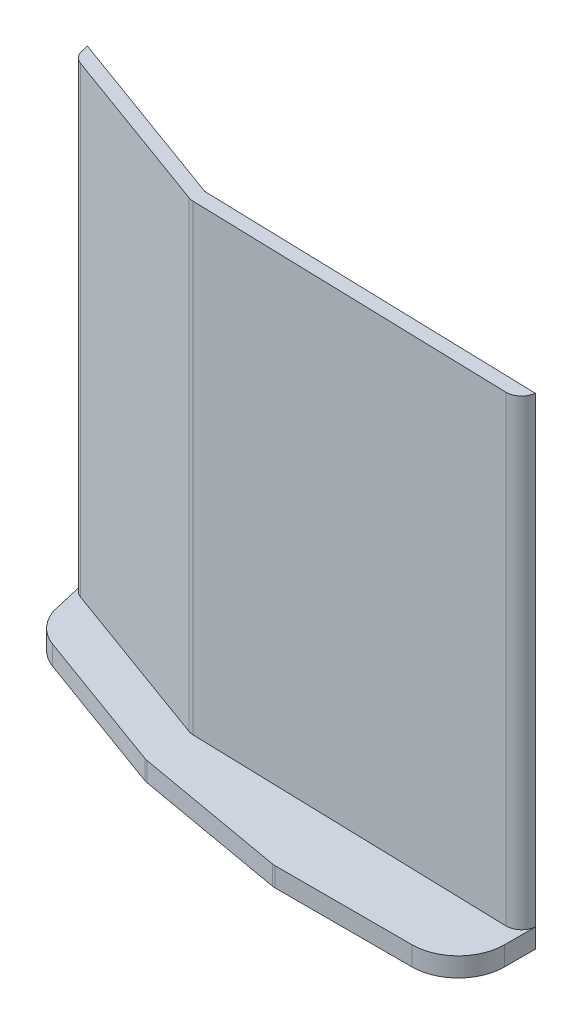
ISO-10303-21;
HEADER;
FILE_DESCRIPTION(('STEP AP214'),'2;1');
FILE_NAME('part.step','',(''),(''),'','','');
FILE_SCHEMA(('AUTOMOTIVE_DESIGN { 1 0 10303 214 1 1 1 1 }'));
ENDSEC;
DATA;
#1=APPLICATION_CONTEXT('core data for automotive mechanical design processes');
#2=APPLICATION_PROTOCOL_DEFINITION('international standard','automotive_design',2000,#1);
#3=PRODUCT_CONTEXT('',#1,'mechanical');
#4=PRODUCT('Part','Part','',(#3));
#5=PRODUCT_RELATED_PRODUCT_CATEGORY('part','',(#4));
#6=PRODUCT_DEFINITION_FORMATION('','',#4);
#7=PRODUCT_DEFINITION_CONTEXT('part definition',#1,'design');
#8=PRODUCT_DEFINITION('design','',#6,#7);
#9=PRODUCT_DEFINITION_SHAPE('','',#8);
#10=(LENGTH_UNIT() NAMED_UNIT(*) SI_UNIT(.MILLI.,.METRE.));
#11=(NAMED_UNIT(*) PLANE_ANGLE_UNIT() SI_UNIT($,.RADIAN.));
#12=(NAMED_UNIT(*) SI_UNIT($,.STERADIAN.) SOLID_ANGLE_UNIT());
#13=UNCERTAINTY_MEASURE_WITH_UNIT(LENGTH_MEASURE(1.E-05),#10,'distance_accuracy_value','');
#14=(GEOMETRIC_REPRESENTATION_CONTEXT(3) GLOBAL_UNCERTAINTY_ASSIGNED_CONTEXT((#13)) GLOBAL_UNIT_ASSIGNED_CONTEXT((#10,
#11,#12)) REPRESENTATION_CONTEXT('',''));
#15=CARTESIAN_POINT('',(0.,0.,0.));
#16=DIRECTION('',(0.,0.,1.));
#17=DIRECTION('',(1.,0.,0.));
#18=AXIS2_PLACEMENT_3D('',#15,#16,#17);
#19=CARTESIAN_POINT('',(0.,3.175,0.));
#20=DIRECTION('',(0.,-1.,0.));
#21=DIRECTION('',(0.,0.,-1.));
#22=AXIS2_PLACEMENT_3D('',#19,#20,#21);
#23=PLANE('',#22);
#24=DIRECTION('',(0.225396784635699,0.,0.974267052442957));
#25=VECTOR('',#24,1.);
#26=CARTESIAN_POINT('',(-84.037962459856,3.175,-1.99982526017494));
#27=LINE('',#26,#25);
#28=CARTESIAN_POINT('',(-86.2213430739946,3.175,-11.4373857770031));
#29=VERTEX_POINT('',#28);
#30=CARTESIAN_POINT('',(-84.9699930134581,3.175,-6.02848370671102));
#31=VERTEX_POINT('',#30);
#32=EDGE_CURVE('E209',#29,#31,#27,.T.);
#33=ORIENTED_EDGE('',*,*,#32,.T.);
#34=CARTESIAN_POINT('',(-77.5460780738428,3.175,-7.74600720563504));
#35=DIRECTION('',(0.,-1.,0.));
#36=DIRECTION('',(0.,0.,-1.));
#37=AXIS2_PLACEMENT_3D('',#34,#35,#36);
#38=CIRCLE('',#37,7.62);
#39=CARTESIAN_POINT('',(-80.1522715659844,3.175,-0.58554943524643));
#40=VERTEX_POINT('',#39);
#41=EDGE_CURVE('E331',#31,#40,#38,.F.);
#42=ORIENTED_EDGE('',*,*,#41,.T.);
#43=DIRECTION('',(0.939692620785908,0.,0.34202014332567));
#44=VECTOR('',#43,1.);
#45=CARTESIAN_POINT('',(-56.0423709130096,3.175,8.18973675355168));
#46=LINE('',#45,#44);
#47=CARTESIAN_POINT('',(-56.2511905398647,3.175,8.11373262504588));
#48=VERTEX_POINT('',#47);
#49=EDGE_CURVE('E213',#40,#48,#46,.T.);
#50=ORIENTED_EDGE('',*,*,#49,.T.);
#51=CARTESIAN_POINT('',(-55.3824593758175,3.175,5.72691336824967));
#52=DIRECTION('',(0.,-1.,0.));
#53=DIRECTION('',(0.,0.,-1.));
#54=AXIS2_PLACEMENT_3D('',#51,#52,#53);
#55=CIRCLE('',#54,2.54);
#56=CARTESIAN_POINT('',(-55.8235257470915,3.175,8.22832506090068));
#57=VERTEX_POINT('',#56);
#58=EDGE_CURVE('E296',#48,#57,#55,.F.);
#59=ORIENTED_EDGE('',*,*,#58,.T.);
#60=DIRECTION('',(0.984807753012208,0.,0.173648177666931));
#61=VECTOR('',#60,1.);
#62=CARTESIAN_POINT('',(-30.4633969617374,3.175,12.7));
#63=LINE('',#62,#61);
#64=CARTESIAN_POINT('',(-30.6822421276556,3.175,12.661411692651));
#65=VERTEX_POINT('',#64);
#66=EDGE_CURVE('E217',#57,#65,#63,.T.);
#67=ORIENTED_EDGE('',*,*,#66,.T.);
#68=CARTESIAN_POINT('',(-30.2411757563816,3.175,10.16));
#69=DIRECTION('',(0.,-1.,0.));
#70=DIRECTION('',(0.,0.,-1.));
#71=AXIS2_PLACEMENT_3D('',#68,#69,#70);
#72=CIRCLE('',#71,2.54);
#73=CARTESIAN_POINT('',(-30.2411757563816,3.175,12.7));
#74=VERTEX_POINT('',#73);
#75=EDGE_CURVE('E299',#65,#74,#72,.F.);
#76=ORIENTED_EDGE('',*,*,#75,.T.);
#77=DIRECTION('',(1.,0.,0.));
#78=VECTOR('',#77,1.);
#79=CARTESIAN_POINT('',(0.,3.175,12.7));
#80=LINE('',#79,#78);
#81=CARTESIAN_POINT('',(-7.62,3.175,12.7));
#82=VERTEX_POINT('',#81);
#83=EDGE_CURVE('E221',#74,#82,#80,.T.);
#84=ORIENTED_EDGE('',*,*,#83,.T.);
#85=CARTESIAN_POINT('',(-7.62,3.175,5.08));
#86=DIRECTION('',(0.,-1.,0.));
#87=DIRECTION('',(0.,0.,-1.));
#88=AXIS2_PLACEMENT_3D('',#85,#86,#87);
#89=CIRCLE('',#88,7.62);
#90=CARTESIAN_POINT('',(0.,3.175,5.08));
#91=VERTEX_POINT('',#90);
#92=EDGE_CURVE('E58',#82,#91,#89,.F.);
#93=ORIENTED_EDGE('',*,*,#92,.T.);
#94=DIRECTION('',(0.,0.,-1.));
#95=VECTOR('',#94,1.);
#96=CARTESIAN_POINT('',(0.,3.175,0.));
#97=LINE('',#96,#95);
#98=CARTESIAN_POINT('',(0.,3.175,0.));
#99=VERTEX_POINT('',#98);
#100=EDGE_CURVE('E224',#91,#99,#97,.T.);
#101=ORIENTED_EDGE('',*,*,#100,.T.);
#102=CARTESIAN_POINT('',(-2.52589044297395,3.175,-0.267352707285457));
#103=DIRECTION('',(0.,-1.,0.));
#104=DIRECTION('',(0.,0.,-1.));
#105=AXIS2_PLACEMENT_3D('',#102,#103,#104);
#106=CIRCLE('',#105,2.54);
#107=CARTESIAN_POINT('',(-2.59691187528868,3.175,2.27165417654766));
#108=VERTEX_POINT('',#107);
#109=EDGE_CURVE('E310',#99,#108,#106,.T.);
#110=ORIENTED_EDGE('',*,*,#109,.T.);
#111=DIRECTION('',(0.999609009383118,0.,0.027961193824695));
#112=VECTOR('',#111,1.);
#113=CARTESIAN_POINT('',(0.,3.175,2.34429533484956));
#114=LINE('',#113,#112);
#115=CARTESIAN_POINT('',(-55.6311930836779,3.175,0.78817233284531));
#116=VERTEX_POINT('',#115);
#117=EDGE_CURVE('E190',#116,#108,#114,.T.);
#118=ORIENTED_EDGE('',*,*,#117,.F.);
#119=CARTESIAN_POINT('',(-55.5601716513632,3.175,-1.75083455098781));
#120=DIRECTION('',(0.,-1.,0.));
#121=DIRECTION('',(0.,0.,-1.));
#122=AXIS2_PLACEMENT_3D('',#119,#120,#121);
#123=CIRCLE('',#122,2.54);
#124=CARTESIAN_POINT('',(-56.4289028154104,3.175,0.635984705808401));
#125=VERTEX_POINT('',#124);
#126=EDGE_CURVE('E313',#116,#125,#123,.T.);
#127=ORIENTED_EDGE('',*,*,#126,.T.);
#128=DIRECTION('',(0.939692620785908,0.,0.34202014332567));
#129=VECTOR('',#128,1.);
#130=CARTESIAN_POINT('',(-56.0423709130096,3.175,0.77667081287656));
#131=LINE('',#130,#129);
#132=CARTESIAN_POINT('',(-84.6154359248367,3.175,-9.62307435318159));
#133=VERTEX_POINT('',#132);
#134=EDGE_CURVE('E194',#133,#125,#131,.T.);
#135=ORIENTED_EDGE('',*,*,#134,.F.);
#136=CARTESIAN_POINT('',(-83.7467047607895,3.175,-12.0098936099778));
#137=DIRECTION('',(0.,-1.,0.));
#138=DIRECTION('',(0.,0.,-1.));
#139=AXIS2_PLACEMENT_3D('',#136,#137,#138);
#140=CIRCLE('',#139,2.54);
#141=EDGE_CURVE('E306',#133,#29,#140,.T.);
#142=ORIENTED_EDGE('',*,*,#141,.T.);
#143=EDGE_LOOP('',(#33,#42,#50,#59,#67,#76,#84,#93,#101,#110,#118,#127,#135,#142));
#144=FACE_BOUND('',#143,.T.);
#145=ADVANCED_FACE('F42',(#144),#23,.F.);
#146=CARTESIAN_POINT('',(-56.0423709130096,3.175,-1.567624521973));
#147=DIRECTION('',(-0.0279611938246951,0.,0.999609009383118));
#148=DIRECTION('',(0.999609009383118,0.,0.0279611938246951));
#149=AXIS2_PLACEMENT_3D('',#146,#147,#148);
#150=PLANE('',#149);
#151=DIRECTION('',(-0.999609009383118,0.,-0.0279611938246951));
#152=VECTOR('',#151,1.);
#153=CARTESIAN_POINT('',(-56.0423709130096,0.,-1.567624521973));
#154=LINE('',#153,#152);
#155=CARTESIAN_POINT('',(0.,0.,0.));
#156=VERTEX_POINT('',#155);
#157=CARTESIAN_POINT('',(-56.0423709130096,0.,-1.567624521973));
#158=VERTEX_POINT('',#157);
#159=EDGE_CURVE('E169',#156,#158,#154,.T.);
#160=ORIENTED_EDGE('',*,*,#159,.T.);
#161=DIRECTION('',(0.,-1.,0.));
#162=VECTOR('',#161,1.);
#163=CARTESIAN_POINT('',(-56.0423709130096,3.175,-1.567624521973));
#164=LINE('',#163,#162);
#165=CARTESIAN_POINT('',(-56.0423709130096,79.375,-1.567624521973));
#166=VERTEX_POINT('',#165);
#167=EDGE_CURVE('E160',#166,#158,#164,.T.);
#168=ORIENTED_EDGE('',*,*,#167,.F.);
#169=DIRECTION('',(-0.999609009383118,0.,-0.0279611938246951));
#170=VECTOR('',#169,1.);
#171=CARTESIAN_POINT('',(-56.0423709130096,79.375,-1.567624521973));
#172=LINE('',#171,#170);
#173=CARTESIAN_POINT('',(0.,79.375,0.));
#174=VERTEX_POINT('',#173);
#175=EDGE_CURVE('E165',#174,#166,#172,.T.);
#176=ORIENTED_EDGE('',*,*,#175,.F.);
#177=DIRECTION('',(0.,-1.,0.));
#178=VECTOR('',#177,1.);
#179=CARTESIAN_POINT('',(0.,3.175,0.));
#180=LINE('',#179,#178);
#181=EDGE_CURVE('E249',#174,#99,#180,.T.);
#182=ORIENTED_EDGE('',*,*,#181,.T.);
#183=EDGE_CURVE('E227',#99,#156,#180,.T.);
#184=ORIENTED_EDGE('',*,*,#183,.T.);
#185=EDGE_LOOP('',(#160,#168,#176,#182,#184));
#186=FACE_BOUND('',#185,.T.);
#187=ADVANCED_FACE('F162',(#186),#150,.F.);
#188=CARTESIAN_POINT('',(-86.5028868680902,3.175,-12.6543456500131));
#189=DIRECTION('',(-0.34202014332567,0.,0.939692620785908));
#190=DIRECTION('',(0.939692620785908,0.,0.34202014332567));
#191=AXIS2_PLACEMENT_3D('',#188,#189,#190);
#192=PLANE('',#191);
#193=DIRECTION('',(-0.939692620785908,0.,-0.34202014332567));
#194=VECTOR('',#193,1.);
#195=CARTESIAN_POINT('',(-86.5028868680902,0.,-12.6543456500131));
#196=LINE('',#195,#194);
#197=CARTESIAN_POINT('',(-86.5028868680902,0.,-12.6543456500131));
#198=VERTEX_POINT('',#197);
#199=EDGE_CURVE('E230',#158,#198,#196,.T.);
#200=ORIENTED_EDGE('',*,*,#199,.T.);
#201=DIRECTION('',(0.,-1.,0.));
#202=VECTOR('',#201,1.);
#203=CARTESIAN_POINT('',(-86.5028868680902,3.175,-12.6543456500131));
#204=LINE('',#203,#202);
#205=CARTESIAN_POINT('',(-86.5028868680902,79.375,-12.6543456500131));
#206=VERTEX_POINT('',#205);
#207=EDGE_CURVE('E173',#206,#198,#204,.T.);
#208=ORIENTED_EDGE('',*,*,#207,.F.);
#209=DIRECTION('',(-0.939692620785908,0.,-0.34202014332567));
#210=VECTOR('',#209,1.);
#211=CARTESIAN_POINT('',(-86.5028868680902,79.375,-12.6543456500131));
#212=LINE('',#211,#210);
#213=EDGE_CURVE('E176',#166,#206,#212,.T.);
#214=ORIENTED_EDGE('',*,*,#213,.F.);
#215=ORIENTED_EDGE('',*,*,#167,.T.);
#216=EDGE_LOOP('',(#200,#208,#214,#215));
#217=FACE_BOUND('',#216,.T.);
#218=ADVANCED_FACE('F177',(#217),#192,.F.);
#219=CARTESIAN_POINT('',(-84.037962459856,3.175,-1.99982526017494));
#220=DIRECTION('',(0.974267052442957,0.,-0.225396784635699));
#221=DIRECTION('',(-0.225396784635699,0.,-0.974267052442958));
#222=AXIS2_PLACEMENT_3D('',#219,#220,#221);
#223=PLANE('',#222);
#224=DIRECTION('',(0.225396784635699,0.,0.974267052442957));
#225=VECTOR('',#224,1.);
#226=CARTESIAN_POINT('',(-84.037962459856,0.,-1.99982526017494));
#227=LINE('',#226,#225);
#228=CARTESIAN_POINT('',(-84.9699930134581,0.,-6.02848370671102));
#229=VERTEX_POINT('',#228);
#230=EDGE_CURVE('E233',#198,#229,#227,.T.);
#231=ORIENTED_EDGE('',*,*,#230,.T.);
#232=DIRECTION('',(0.,-1.,0.));
#233=VECTOR('',#232,1.);
#234=CARTESIAN_POINT('',(-84.9699930134581,3.175,-6.02848370671102));
#235=LINE('',#234,#233);
#236=EDGE_CURVE('E326',#229,#31,#235,.F.);
#237=ORIENTED_EDGE('',*,*,#236,.T.);
#238=ORIENTED_EDGE('',*,*,#32,.F.);
#239=DIRECTION('',(0.,-1.,0.));
#240=VECTOR('',#239,1.);
#241=CARTESIAN_POINT('',(-86.2213430739946,3.175,-11.4373857770031));
#242=LINE('',#241,#240);
#243=CARTESIAN_POINT('',(-86.2213430739946,79.375,-11.4373857770031));
#244=VERTEX_POINT('',#243);
#245=EDGE_CURVE('E260',#29,#244,#242,.F.);
#246=ORIENTED_EDGE('',*,*,#245,.T.);
#247=DIRECTION('',(0.225396784635697,0.,0.974267052442958));
#248=VECTOR('',#247,1.);
#249=CARTESIAN_POINT('',(-85.9106662227939,79.375,-10.0944996281578));
#250=LINE('',#249,#248);
#251=EDGE_CURVE('E183',#206,#244,#250,.T.);
#252=ORIENTED_EDGE('',*,*,#251,.F.);
#253=ORIENTED_EDGE('',*,*,#207,.T.);
#254=EDGE_LOOP('',(#231,#237,#238,#246,#252,#253));
#255=FACE_BOUND('',#254,.T.);
#256=ADVANCED_FACE('F347',(#255),#223,.F.);
#257=CARTESIAN_POINT('',(-56.0423709130096,3.175,8.18973675355168));
#258=DIRECTION('',(0.34202014332567,0.,-0.939692620785908));
#259=DIRECTION('',(-0.939692620785908,0.,-0.34202014332567));
#260=AXIS2_PLACEMENT_3D('',#257,#258,#259);
#261=PLANE('',#260);
#262=ORIENTED_EDGE('',*,*,#49,.F.);
#263=DIRECTION('',(0.,-1.,0.));
#264=VECTOR('',#263,1.);
#265=CARTESIAN_POINT('',(-80.1522715659844,3.175,-0.585549435246427));
#266=LINE('',#265,#264);
#267=CARTESIAN_POINT('',(-80.1522715659844,0.,-0.58554943524643));
#268=VERTEX_POINT('',#267);
#269=EDGE_CURVE('E316',#40,#268,#266,.T.);
#270=ORIENTED_EDGE('',*,*,#269,.T.);
#271=DIRECTION('',(0.939692620785908,0.,0.34202014332567));
#272=VECTOR('',#271,1.);
#273=CARTESIAN_POINT('',(-56.0423709130096,0.,8.18973675355168));
#274=LINE('',#273,#272);
#275=CARTESIAN_POINT('',(-56.2511905398647,0.,8.11373262504588));
#276=VERTEX_POINT('',#275);
#277=EDGE_CURVE('E237',#268,#276,#274,.T.);
#278=ORIENTED_EDGE('',*,*,#277,.T.);
#279=DIRECTION('',(0.,-1.,0.));
#280=VECTOR('',#279,1.);
#281=CARTESIAN_POINT('',(-56.2511905398647,3.175,8.11373262504588));
#282=LINE('',#281,#280);
#283=EDGE_CURVE('E302',#276,#48,#282,.F.);
#284=ORIENTED_EDGE('',*,*,#283,.T.);
#285=EDGE_LOOP('',(#262,#270,#278,#284));
#286=FACE_BOUND('',#285,.T.);
#287=ADVANCED_FACE('F404',(#286),#261,.F.);
#288=CARTESIAN_POINT('',(-30.4633969617374,3.175,12.7));
#289=DIRECTION('',(0.173648177666931,0.,-0.984807753012208));
#290=DIRECTION('',(-0.984807753012208,0.,-0.173648177666931));
#291=AXIS2_PLACEMENT_3D('',#288,#289,#290);
#292=PLANE('',#291);
#293=DIRECTION('',(0.984807753012208,0.,0.173648177666931));
#294=VECTOR('',#293,1.);
#295=CARTESIAN_POINT('',(-30.4633969617374,0.,12.7));
#296=LINE('',#295,#294);
#297=CARTESIAN_POINT('',(-55.8235257470915,0.,8.22832506090068));
#298=VERTEX_POINT('',#297);
#299=CARTESIAN_POINT('',(-30.6822421276556,0.,12.661411692651));
#300=VERTEX_POINT('',#299);
#301=EDGE_CURVE('E240',#298,#300,#296,.T.);
#302=ORIENTED_EDGE('',*,*,#301,.T.);
#303=DIRECTION('',(0.,-1.,0.));
#304=VECTOR('',#303,1.);
#305=CARTESIAN_POINT('',(-30.6822421276556,3.175,12.661411692651));
#306=LINE('',#305,#304);
#307=EDGE_CURVE('E293',#300,#65,#306,.F.);
#308=ORIENTED_EDGE('',*,*,#307,.T.);
#309=ORIENTED_EDGE('',*,*,#66,.F.);
#310=DIRECTION('',(0.,-1.,0.));
#311=VECTOR('',#310,1.);
#312=CARTESIAN_POINT('',(-55.8235257470915,3.175,8.22832506090068));
#313=LINE('',#312,#311);
#314=EDGE_CURVE('E289',#57,#298,#313,.T.);
#315=ORIENTED_EDGE('',*,*,#314,.T.);
#316=EDGE_LOOP('',(#302,#308,#309,#315));
#317=FACE_BOUND('',#316,.T.);
#318=ADVANCED_FACE('F401',(#317),#292,.F.);
#319=CARTESIAN_POINT('',(0.,3.175,12.7));
#320=DIRECTION('',(0.,0.,-1.));
#321=DIRECTION('',(-1.,0.,0.));
#322=AXIS2_PLACEMENT_3D('',#319,#320,#321);
#323=PLANE('',#322);
#324=DIRECTION('',(1.,0.,0.));
#325=VECTOR('',#324,1.);
#326=CARTESIAN_POINT('',(0.,0.,12.7));
#327=LINE('',#326,#325);
#328=CARTESIAN_POINT('',(-30.2411757563816,0.,12.7));
#329=VERTEX_POINT('',#328);
#330=CARTESIAN_POINT('',(-7.62,0.,12.7));
#331=VERTEX_POINT('',#330);
#332=EDGE_CURVE('E244',#329,#331,#327,.T.);
#333=ORIENTED_EDGE('',*,*,#332,.T.);
#334=DIRECTION('',(0.,-1.,0.));
#335=VECTOR('',#334,1.);
#336=CARTESIAN_POINT('',(-7.62,3.175,12.7));
#337=LINE('',#336,#335);
#338=EDGE_CURVE('E11',#331,#82,#337,.F.);
#339=ORIENTED_EDGE('',*,*,#338,.T.);
#340=ORIENTED_EDGE('',*,*,#83,.F.);
#341=DIRECTION('',(0.,-1.,0.));
#342=VECTOR('',#341,1.);
#343=CARTESIAN_POINT('',(-30.2411757563816,3.175,12.7));
#344=LINE('',#343,#342);
#345=EDGE_CURVE('E278',#74,#329,#344,.T.);
#346=ORIENTED_EDGE('',*,*,#345,.T.);
#347=EDGE_LOOP('',(#333,#339,#340,#346));
#348=FACE_BOUND('',#347,.T.);
#349=ADVANCED_FACE('F398',(#348),#323,.F.);
#350=CARTESIAN_POINT('',(0.,3.175,0.));
#351=DIRECTION('',(-1.,0.,0.));
#352=DIRECTION('',(0.,0.,1.));
#353=AXIS2_PLACEMENT_3D('',#350,#351,#352);
#354=PLANE('',#353);
#355=ORIENTED_EDGE('',*,*,#100,.F.);
#356=DIRECTION('',(0.,-1.,0.));
#357=VECTOR('',#356,1.);
#358=CARTESIAN_POINT('',(0.,3.175,5.08));
#359=LINE('',#358,#357);
#360=CARTESIAN_POINT('',(0.,0.,5.08));
#361=VERTEX_POINT('',#360);
#362=EDGE_CURVE('E51',#91,#361,#359,.T.);
#363=ORIENTED_EDGE('',*,*,#362,.T.);
#364=DIRECTION('',(0.,0.,-1.));
#365=VECTOR('',#364,1.);
#366=CARTESIAN_POINT('',(0.,0.,0.));
#367=LINE('',#366,#365);
#368=EDGE_CURVE('E214',#361,#156,#367,.T.);
#369=ORIENTED_EDGE('',*,*,#368,.T.);
#370=ORIENTED_EDGE('',*,*,#183,.F.);
#371=EDGE_LOOP('',(#355,#363,#369,#370));
#372=FACE_BOUND('',#371,.T.);
#373=ADVANCED_FACE('F338',(#372),#354,.F.);
#374=CARTESIAN_POINT('',(0.,0.,0.));
#375=DIRECTION('',(0.,-1.,0.));
#376=DIRECTION('',(0.,0.,-1.));
#377=AXIS2_PLACEMENT_3D('',#374,#375,#376);
#378=PLANE('',#377);
#379=ORIENTED_EDGE('',*,*,#277,.F.);
#380=CARTESIAN_POINT('',(-77.5460780738428,0.,-7.74600720563504));
#381=DIRECTION('',(0.,-1.,0.));
#382=DIRECTION('',(0.,0.,-1.));
#383=AXIS2_PLACEMENT_3D('',#380,#381,#382);
#384=CIRCLE('',#383,7.62);
#385=EDGE_CURVE('E323',#268,#229,#384,.T.);
#386=ORIENTED_EDGE('',*,*,#385,.T.);
#387=ORIENTED_EDGE('',*,*,#230,.F.);
#388=ORIENTED_EDGE('',*,*,#199,.F.);
#389=ORIENTED_EDGE('',*,*,#159,.F.);
#390=ORIENTED_EDGE('',*,*,#368,.F.);
#391=CARTESIAN_POINT('',(-7.62,0.,5.08));
#392=DIRECTION('',(0.,-1.,0.));
#393=DIRECTION('',(0.,0.,-1.));
#394=AXIS2_PLACEMENT_3D('',#391,#392,#393);
#395=CIRCLE('',#394,7.62);
#396=EDGE_CURVE('E320',#361,#331,#395,.T.);
#397=ORIENTED_EDGE('',*,*,#396,.T.);
#398=ORIENTED_EDGE('',*,*,#332,.F.);
#399=CARTESIAN_POINT('',(-30.2411757563816,0.,10.16));
#400=DIRECTION('',(0.,-1.,0.));
#401=DIRECTION('',(0.,0.,-1.));
#402=AXIS2_PLACEMENT_3D('',#399,#400,#401);
#403=CIRCLE('',#402,2.54);
#404=EDGE_CURVE('E286',#329,#300,#403,.T.);
#405=ORIENTED_EDGE('',*,*,#404,.T.);
#406=ORIENTED_EDGE('',*,*,#301,.F.);
#407=CARTESIAN_POINT('',(-55.3824593758175,0.,5.72691336824967));
#408=DIRECTION('',(0.,-1.,0.));
#409=DIRECTION('',(0.,0.,-1.));
#410=AXIS2_PLACEMENT_3D('',#407,#408,#409);
#411=CIRCLE('',#410,2.54);
#412=EDGE_CURVE('E282',#298,#276,#411,.T.);
#413=ORIENTED_EDGE('',*,*,#412,.T.);
#414=EDGE_LOOP('',(#379,#386,#387,#388,#389,#390,#397,#398,#405,#406,#413));
#415=FACE_BOUND('',#414,.T.);
#416=ADVANCED_FACE('F343',(#415),#378,.T.);
#417=CARTESIAN_POINT('',(-56.0423709130096,79.375,0.77667081287656));
#418=DIRECTION('',(0.34202014332567,0.,-0.939692620785908));
#419=DIRECTION('',(-0.939692620785908,0.,-0.34202014332567));
#420=AXIS2_PLACEMENT_3D('',#417,#418,#419);
#421=PLANE('',#420);
#422=DIRECTION('',(0.939692620785908,0.,0.34202014332567));
#423=VECTOR('',#422,1.);
#424=CARTESIAN_POINT('',(-56.0423709130096,79.375,0.77667081287656));
#425=LINE('',#424,#423);
#426=CARTESIAN_POINT('',(-84.6154359248367,79.375,-9.62307435318159));
#427=VERTEX_POINT('',#426);
#428=CARTESIAN_POINT('',(-56.4289028154104,79.375,0.635984705808401));
#429=VERTEX_POINT('',#428);
#430=EDGE_CURVE('E199',#427,#429,#425,.T.);
#431=ORIENTED_EDGE('',*,*,#430,.F.);
#432=DIRECTION('',(0.,-1.,0.));
#433=VECTOR('',#432,1.);
#434=CARTESIAN_POINT('',(-84.6154359248367,79.375,-9.62307435318159));
#435=LINE('',#434,#433);
#436=EDGE_CURVE('E256',#427,#133,#435,.T.);
#437=ORIENTED_EDGE('',*,*,#436,.T.);
#438=ORIENTED_EDGE('',*,*,#134,.T.);
#439=DIRECTION('',(0.,-1.,0.));
#440=VECTOR('',#439,1.);
#441=CARTESIAN_POINT('',(-56.4289028154104,79.375,0.635984705808401));
#442=LINE('',#441,#440);
#443=EDGE_CURVE('E172',#125,#429,#442,.F.);
#444=ORIENTED_EDGE('',*,*,#443,.T.);
#445=EDGE_LOOP('',(#431,#437,#438,#444));
#446=FACE_BOUND('',#445,.T.);
#447=ADVANCED_FACE('F357',(#446),#421,.F.);
#448=CARTESIAN_POINT('',(0.,79.375,2.34429533484956));
#449=DIRECTION('',(0.027961193824695,0.,-0.999609009383118));
#450=DIRECTION('',(-0.999609009383118,0.,-0.027961193824695));
#451=AXIS2_PLACEMENT_3D('',#448,#449,#450);
#452=PLANE('',#451);
#453=ORIENTED_EDGE('',*,*,#117,.T.);
#454=DIRECTION('',(0.,1.,0.));
#455=VECTOR('',#454,1.);
#456=CARTESIAN_POINT('',(-2.59691187528868,79.375,2.27165417654766));
#457=LINE('',#456,#455);
#458=CARTESIAN_POINT('',(-2.59691187528868,79.375,2.27165417654766));
#459=VERTEX_POINT('',#458);
#460=EDGE_CURVE('E275',#108,#459,#457,.T.);
#461=ORIENTED_EDGE('',*,*,#460,.T.);
#462=DIRECTION('',(0.999609009383118,0.,0.027961193824695));
#463=VECTOR('',#462,1.);
#464=CARTESIAN_POINT('',(0.,79.375,2.34429533484956));
#465=LINE('',#464,#463);
#466=CARTESIAN_POINT('',(-55.6311930836779,79.375,0.78817233284531));
#467=VERTEX_POINT('',#466);
#468=EDGE_CURVE('E203',#467,#459,#465,.T.);
#469=ORIENTED_EDGE('',*,*,#468,.F.);
#470=DIRECTION('',(0.,-1.,0.));
#471=VECTOR('',#470,1.);
#472=CARTESIAN_POINT('',(-55.6311930836779,79.375,0.78817233284531));
#473=LINE('',#472,#471);
#474=EDGE_CURVE('E271',#467,#116,#473,.T.);
#475=ORIENTED_EDGE('',*,*,#474,.T.);
#476=EDGE_LOOP('',(#453,#461,#469,#475));
#477=FACE_BOUND('',#476,.T.);
#478=ADVANCED_FACE('F366',(#477),#452,.F.);
#479=CARTESIAN_POINT('',(0.,79.375,0.));
#480=DIRECTION('',(0.,-1.,0.));
#481=DIRECTION('',(0.,0.,-1.));
#482=AXIS2_PLACEMENT_3D('',#479,#480,#481);
#483=PLANE('',#482);
#484=ORIENTED_EDGE('',*,*,#251,.T.);
#485=CARTESIAN_POINT('',(-83.7467047607895,79.375,-12.0098936099778));
#486=DIRECTION('',(0.,-1.,0.));
#487=DIRECTION('',(0.,0.,-1.));
#488=AXIS2_PLACEMENT_3D('',#485,#486,#487);
#489=CIRCLE('',#488,2.54);
#490=EDGE_CURVE('E268',#244,#427,#489,.F.);
#491=ORIENTED_EDGE('',*,*,#490,.T.);
#492=ORIENTED_EDGE('',*,*,#430,.T.);
#493=CARTESIAN_POINT('',(-55.5601716513632,79.375,-1.75083455098781));
#494=DIRECTION('',(0.,-1.,0.));
#495=DIRECTION('',(0.,0.,-1.));
#496=AXIS2_PLACEMENT_3D('',#493,#494,#495);
#497=CIRCLE('',#496,2.54);
#498=EDGE_CURVE('E263',#429,#467,#497,.F.);
#499=ORIENTED_EDGE('',*,*,#498,.T.);
#500=ORIENTED_EDGE('',*,*,#468,.T.);
#501=CARTESIAN_POINT('',(-2.52589044297395,79.375,-0.267352707285457));
#502=DIRECTION('',(0.,-1.,0.));
#503=DIRECTION('',(0.,0.,-1.));
#504=AXIS2_PLACEMENT_3D('',#501,#502,#503);
#505=CIRCLE('',#504,2.54);
#506=EDGE_CURVE('E188',#459,#174,#505,.F.);
#507=ORIENTED_EDGE('',*,*,#506,.T.);
#508=ORIENTED_EDGE('',*,*,#175,.T.);
#509=ORIENTED_EDGE('',*,*,#213,.T.);
#510=EDGE_LOOP('',(#484,#491,#492,#499,#500,#507,#508,#509));
#511=FACE_BOUND('',#510,.T.);
#512=ADVANCED_FACE('F185',(#511),#483,.F.);
#513=CARTESIAN_POINT('',(-83.7467047607895,79.375,-12.0098936099778));
#514=DIRECTION('',(0.,-1.,0.));
#515=DIRECTION('',(0.,0.,-1.));
#516=AXIS2_PLACEMENT_3D('',#513,#514,#515);
#517=CYLINDRICAL_SURFACE('',#516,2.54);
#518=ORIENTED_EDGE('',*,*,#490,.F.);
#519=ORIENTED_EDGE('',*,*,#245,.F.);
#520=ORIENTED_EDGE('',*,*,#141,.F.);
#521=ORIENTED_EDGE('',*,*,#436,.F.);
#522=EDGE_LOOP('',(#518,#519,#520,#521));
#523=FACE_BOUND('',#522,.T.);
#524=ADVANCED_FACE('F354',(#523),#517,.T.);
#525=CARTESIAN_POINT('',(-2.52589044297395,3.175,-0.267352707285457));
#526=DIRECTION('',(0.,1.,0.));
#527=DIRECTION('',(0.,0.,1.));
#528=AXIS2_PLACEMENT_3D('',#525,#526,#527);
#529=CYLINDRICAL_SURFACE('',#528,2.54);
#530=ORIENTED_EDGE('',*,*,#506,.F.);
#531=ORIENTED_EDGE('',*,*,#460,.F.);
#532=ORIENTED_EDGE('',*,*,#109,.F.);
#533=ORIENTED_EDGE('',*,*,#181,.F.);
#534=EDGE_LOOP('',(#530,#531,#532,#533));
#535=FACE_BOUND('',#534,.T.);
#536=ADVANCED_FACE('F369',(#535),#529,.T.);
#537=CARTESIAN_POINT('',(-30.2411757563816,3.175,10.16));
#538=DIRECTION('',(0.,-1.,0.));
#539=DIRECTION('',(0.,0.,-1.));
#540=AXIS2_PLACEMENT_3D('',#537,#538,#539);
#541=CYLINDRICAL_SURFACE('',#540,2.54);
#542=ORIENTED_EDGE('',*,*,#75,.F.);
#543=ORIENTED_EDGE('',*,*,#307,.F.);
#544=ORIENTED_EDGE('',*,*,#404,.F.);
#545=ORIENTED_EDGE('',*,*,#345,.F.);
#546=EDGE_LOOP('',(#542,#543,#544,#545));
#547=FACE_BOUND('',#546,.T.);
#548=ADVANCED_FACE('F373',(#547),#541,.T.);
#549=CARTESIAN_POINT('',(-55.3824593758175,3.175,5.72691336824967));
#550=DIRECTION('',(0.,-1.,0.));
#551=DIRECTION('',(0.,0.,-1.));
#552=AXIS2_PLACEMENT_3D('',#549,#550,#551);
#553=CYLINDRICAL_SURFACE('',#552,2.54);
#554=ORIENTED_EDGE('',*,*,#58,.F.);
#555=ORIENTED_EDGE('',*,*,#283,.F.);
#556=ORIENTED_EDGE('',*,*,#412,.F.);
#557=ORIENTED_EDGE('',*,*,#314,.F.);
#558=EDGE_LOOP('',(#554,#555,#556,#557));
#559=FACE_BOUND('',#558,.T.);
#560=ADVANCED_FACE('F379',(#559),#553,.T.);
#561=CARTESIAN_POINT('',(-55.5601716513632,79.375,-1.75083455098781));
#562=DIRECTION('',(0.,-1.,0.));
#563=DIRECTION('',(0.,0.,-1.));
#564=AXIS2_PLACEMENT_3D('',#561,#562,#563);
#565=CYLINDRICAL_SURFACE('',#564,2.54);
#566=ORIENTED_EDGE('',*,*,#498,.F.);
#567=ORIENTED_EDGE('',*,*,#443,.F.);
#568=ORIENTED_EDGE('',*,*,#126,.F.);
#569=ORIENTED_EDGE('',*,*,#474,.F.);
#570=EDGE_LOOP('',(#566,#567,#568,#569));
#571=FACE_BOUND('',#570,.T.);
#572=ADVANCED_FACE('F363',(#571),#565,.T.);
#573=CARTESIAN_POINT('',(-77.5460780738428,3.175,-7.74600720563504));
#574=DIRECTION('',(0.,-1.,0.));
#575=DIRECTION('',(0.,0.,-1.));
#576=AXIS2_PLACEMENT_3D('',#573,#574,#575);
#577=CYLINDRICAL_SURFACE('',#576,7.62);
#578=ORIENTED_EDGE('',*,*,#41,.F.);
#579=ORIENTED_EDGE('',*,*,#236,.F.);
#580=ORIENTED_EDGE('',*,*,#385,.F.);
#581=ORIENTED_EDGE('',*,*,#269,.F.);
#582=EDGE_LOOP('',(#578,#579,#580,#581));
#583=FACE_BOUND('',#582,.T.);
#584=ADVANCED_FACE('F519',(#583),#577,.T.);
#585=CARTESIAN_POINT('',(-7.62,3.175,5.08));
#586=DIRECTION('',(0.,-1.,0.));
#587=DIRECTION('',(0.,0.,-1.));
#588=AXIS2_PLACEMENT_3D('',#585,#586,#587);
#589=CYLINDRICAL_SURFACE('',#588,7.62);
#590=ORIENTED_EDGE('',*,*,#92,.F.);
#591=ORIENTED_EDGE('',*,*,#338,.F.);
#592=ORIENTED_EDGE('',*,*,#396,.F.);
#593=ORIENTED_EDGE('',*,*,#362,.F.);
#594=EDGE_LOOP('',(#590,#591,#592,#593));
#595=FACE_BOUND('',#594,.T.);
#596=ADVANCED_FACE('F44',(#595),#589,.T.);
#597=CLOSED_SHELL('',(#145,#187,#218,#256,#287,#318,#349,#373,#416,#447,#478,#512,#524,#536,
#548,#560,#572,#584,#596));
#598=MANIFOLD_SOLID_BREP('B2',#597);
#599=ADVANCED_BREP_SHAPE_REPRESENTATION('',(#18,#598),#14);
#600=SHAPE_DEFINITION_REPRESENTATION(#9,#599);
ENDSEC;
END-ISO-10303-21;
